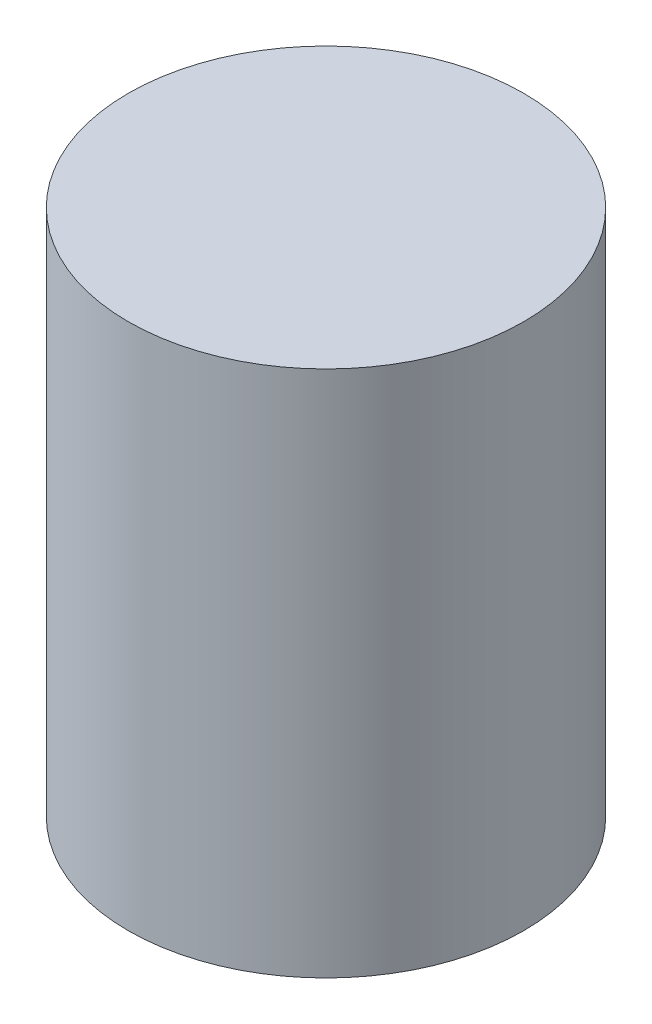
ISO-10303-21;
HEADER;
FILE_DESCRIPTION(('STEP AP214'),'2;1');
FILE_NAME('part.step','',(''),(''),'','','');
FILE_SCHEMA(('AUTOMOTIVE_DESIGN { 1 0 10303 214 1 1 1 1 }'));
ENDSEC;
DATA;
#1=APPLICATION_CONTEXT('core data for automotive mechanical design processes');
#2=APPLICATION_PROTOCOL_DEFINITION('international standard','automotive_design',2000,#1);
#3=PRODUCT_CONTEXT('',#1,'mechanical');
#4=PRODUCT('Part','Part','',(#3));
#5=PRODUCT_RELATED_PRODUCT_CATEGORY('part','',(#4));
#6=PRODUCT_DEFINITION_FORMATION('','',#4);
#7=PRODUCT_DEFINITION_CONTEXT('part definition',#1,'design');
#8=PRODUCT_DEFINITION('design','',#6,#7);
#9=PRODUCT_DEFINITION_SHAPE('','',#8);
#10=(LENGTH_UNIT() NAMED_UNIT(*) SI_UNIT(.MILLI.,.METRE.));
#11=(NAMED_UNIT(*) PLANE_ANGLE_UNIT() SI_UNIT($,.RADIAN.));
#12=(NAMED_UNIT(*) SI_UNIT($,.STERADIAN.) SOLID_ANGLE_UNIT());
#13=UNCERTAINTY_MEASURE_WITH_UNIT(LENGTH_MEASURE(1.E-05),#10,'distance_accuracy_value','');
#14=(GEOMETRIC_REPRESENTATION_CONTEXT(3) GLOBAL_UNCERTAINTY_ASSIGNED_CONTEXT((#13)) GLOBAL_UNIT_ASSIGNED_CONTEXT((#10,
#11,#12)) REPRESENTATION_CONTEXT('',''));
#15=CARTESIAN_POINT('',(0.,0.,0.));
#16=DIRECTION('',(0.,0.,1.));
#17=DIRECTION('',(1.,0.,0.));
#18=AXIS2_PLACEMENT_3D('',#15,#16,#17);
#19=CARTESIAN_POINT('',(0.,40.,0.));
#20=DIRECTION('',(0.,-1.,0.));
#21=DIRECTION('',(0.,0.,-1.));
#22=AXIS2_PLACEMENT_3D('',#19,#20,#21);
#23=CYLINDRICAL_SURFACE('',#22,15.);
#24=CARTESIAN_POINT('',(0.,40.,0.));
#25=DIRECTION('',(0.,1.,0.));
#26=DIRECTION('',(0.,0.,1.));
#27=AXIS2_PLACEMENT_3D('',#24,#25,#26);
#28=CIRCLE('',#27,15.);
#29=CARTESIAN_POINT('',(0.,40.,15.));
#30=VERTEX_POINT('',#29);
#31=EDGE_CURVE('E10',#30,#30,#28,.T.);
#32=ORIENTED_EDGE('',*,*,#31,.F.);
#33=EDGE_LOOP('',(#32));
#34=FACE_BOUND('',#33,.T.);
#35=CARTESIAN_POINT('',(0.,0.,0.));
#36=DIRECTION('',(0.,1.,0.));
#37=DIRECTION('',(0.,0.,1.));
#38=AXIS2_PLACEMENT_3D('',#35,#36,#37);
#39=CIRCLE('',#38,15.);
#40=CARTESIAN_POINT('',(0.,0.,15.));
#41=VERTEX_POINT('',#40);
#42=EDGE_CURVE('E34',#41,#41,#39,.T.);
#43=ORIENTED_EDGE('',*,*,#42,.T.);
#44=EDGE_LOOP('',(#43));
#45=FACE_BOUND('',#44,.T.);
#46=ADVANCED_FACE('F31',(#34,#45),#23,.T.);
#47=CARTESIAN_POINT('',(0.,40.,0.));
#48=DIRECTION('',(0.,1.,0.));
#49=DIRECTION('',(0.,0.,1.));
#50=AXIS2_PLACEMENT_3D('',#47,#48,#49);
#51=PLANE('',#50);
#52=ORIENTED_EDGE('',*,*,#31,.T.);
#53=EDGE_LOOP('',(#52));
#54=FACE_BOUND('',#53,.T.);
#55=ADVANCED_FACE('F46',(#54),#51,.T.);
#56=CARTESIAN_POINT('',(0.,0.,0.));
#57=DIRECTION('',(0.,1.,0.));
#58=DIRECTION('',(0.,0.,1.));
#59=AXIS2_PLACEMENT_3D('',#56,#57,#58);
#60=PLANE('',#59);
#61=ORIENTED_EDGE('',*,*,#42,.F.);
#62=EDGE_LOOP('',(#61));
#63=FACE_BOUND('',#62,.T.);
#64=ADVANCED_FACE('F44',(#63),#60,.F.);
#65=CLOSED_SHELL('',(#46,#55,#64));
#66=MANIFOLD_SOLID_BREP('B2',#65);
#67=ADVANCED_BREP_SHAPE_REPRESENTATION('',(#18,#66),#14);
#68=SHAPE_DEFINITION_REPRESENTATION(#9,#67);
ENDSEC;
END-ISO-10303-21;
